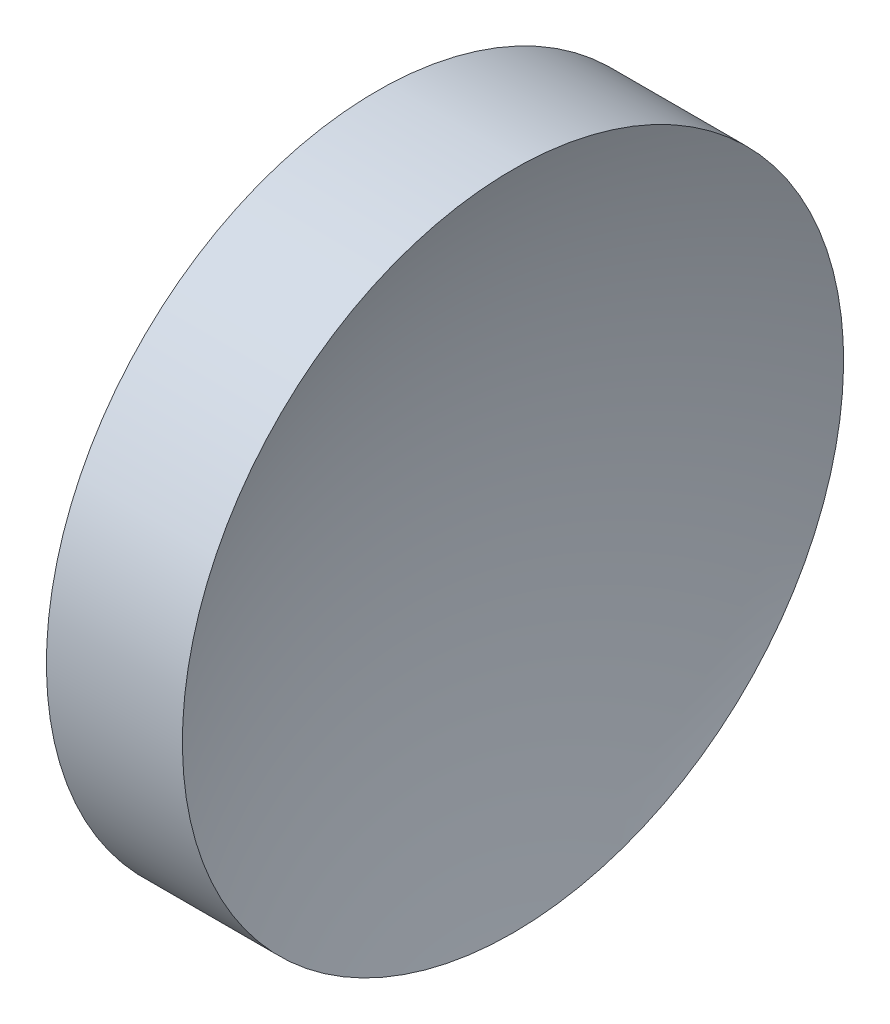
ISO-10303-21;
HEADER;
FILE_DESCRIPTION(('STEP AP214'),'2;1');
FILE_NAME('part.step','',(''),(''),'','','');
FILE_SCHEMA(('AUTOMOTIVE_DESIGN { 1 0 10303 214 1 1 1 1 }'));
ENDSEC;
DATA;
#1=APPLICATION_CONTEXT('core data for automotive mechanical design processes');
#2=APPLICATION_PROTOCOL_DEFINITION('international standard','automotive_design',2000,#1);
#3=PRODUCT_CONTEXT('',#1,'mechanical');
#4=PRODUCT('Part','Part','',(#3));
#5=PRODUCT_RELATED_PRODUCT_CATEGORY('part','',(#4));
#6=PRODUCT_DEFINITION_FORMATION('','',#4);
#7=PRODUCT_DEFINITION_CONTEXT('part definition',#1,'design');
#8=PRODUCT_DEFINITION('design','',#6,#7);
#9=PRODUCT_DEFINITION_SHAPE('','',#8);
#10=(LENGTH_UNIT() NAMED_UNIT(*) SI_UNIT(.MILLI.,.METRE.));
#11=(NAMED_UNIT(*) PLANE_ANGLE_UNIT() SI_UNIT($,.RADIAN.));
#12=(NAMED_UNIT(*) SI_UNIT($,.STERADIAN.) SOLID_ANGLE_UNIT());
#13=UNCERTAINTY_MEASURE_WITH_UNIT(LENGTH_MEASURE(1.E-05),#10,'distance_accuracy_value','');
#14=(GEOMETRIC_REPRESENTATION_CONTEXT(3) GLOBAL_UNCERTAINTY_ASSIGNED_CONTEXT((#13)) GLOBAL_UNIT_ASSIGNED_CONTEXT((#10,
#11,#12)) REPRESENTATION_CONTEXT('',''));
#15=CARTESIAN_POINT('',(0.,0.,0.));
#16=DIRECTION('',(0.,0.,1.));
#17=DIRECTION('',(1.,0.,0.));
#18=AXIS2_PLACEMENT_3D('',#15,#16,#17);
#19=CARTESIAN_POINT('',(74.5254700993222,26.0232999408973,0.));
#20=DIRECTION('',(-1.,0.,0.));
#21=DIRECTION('',(0.,-1.,0.));
#22=AXIS2_PLACEMENT_3D('',#19,#20,#21);
#23=SPHERICAL_SURFACE('',#22,25.84);
#24=CARTESIAN_POINT('',(50.6988966990197,26.0232999408973,0.));
#25=DIRECTION('',(-1.,0.,0.));
#26=DIRECTION('',(0.,-1.,0.));
#27=AXIS2_PLACEMENT_3D('',#24,#25,#26);
#28=CIRCLE('',#27,10.);
#29=CARTESIAN_POINT('',(50.6988966990197,16.0232999408973,0.));
#30=VERTEX_POINT('',#29);
#31=EDGE_CURVE('E10',#30,#30,#28,.T.);
#32=ORIENTED_EDGE('',*,*,#31,.F.);
#33=EDGE_LOOP('',(#32));
#34=FACE_BOUND('',#33,.T.);
#35=ADVANCED_FACE('F35',(#34),#23,.F.);
#36=CARTESIAN_POINT('',(44.7048336724422,26.0232999408973,0.));
#37=DIRECTION('',(-1.,0.,0.));
#38=DIRECTION('',(0.,-1.,0.));
#39=AXIS2_PLACEMENT_3D('',#36,#37,#38);
#40=CYLINDRICAL_SURFACE('',#39,10.);
#41=CARTESIAN_POINT('',(46.5854700993222,26.0232999408973,0.));
#42=DIRECTION('',(-1.,0.,0.));
#43=DIRECTION('',(0.,-1.,0.));
#44=AXIS2_PLACEMENT_3D('',#41,#42,#43);
#45=CIRCLE('',#44,10.);
#46=CARTESIAN_POINT('',(46.5854700993222,16.0232999408973,0.));
#47=VERTEX_POINT('',#46);
#48=EDGE_CURVE('E41',#47,#47,#45,.T.);
#49=ORIENTED_EDGE('',*,*,#48,.F.);
#50=EDGE_LOOP('',(#49));
#51=FACE_BOUND('',#50,.T.);
#52=ORIENTED_EDGE('',*,*,#31,.T.);
#53=EDGE_LOOP('',(#52));
#54=FACE_BOUND('',#53,.T.);
#55=ADVANCED_FACE('F49',(#51,#54),#40,.T.);
#56=CARTESIAN_POINT('',(46.5854700993222,26.0232999408973,0.));
#57=DIRECTION('',(1.,0.,0.));
#58=DIRECTION('',(0.,1.,0.));
#59=AXIS2_PLACEMENT_3D('',#56,#57,#58);
#60=PLANE('',#59);
#61=ORIENTED_EDGE('',*,*,#48,.T.);
#62=EDGE_LOOP('',(#61));
#63=FACE_BOUND('',#62,.T.);
#64=ADVANCED_FACE('F47',(#63),#60,.F.);
#65=CLOSED_SHELL('',(#35,#55,#64));
#66=MANIFOLD_SOLID_BREP('B2',#65);
#67=ADVANCED_BREP_SHAPE_REPRESENTATION('',(#18,#66),#14);
#68=SHAPE_DEFINITION_REPRESENTATION(#9,#67);
ENDSEC;
END-ISO-10303-21;
